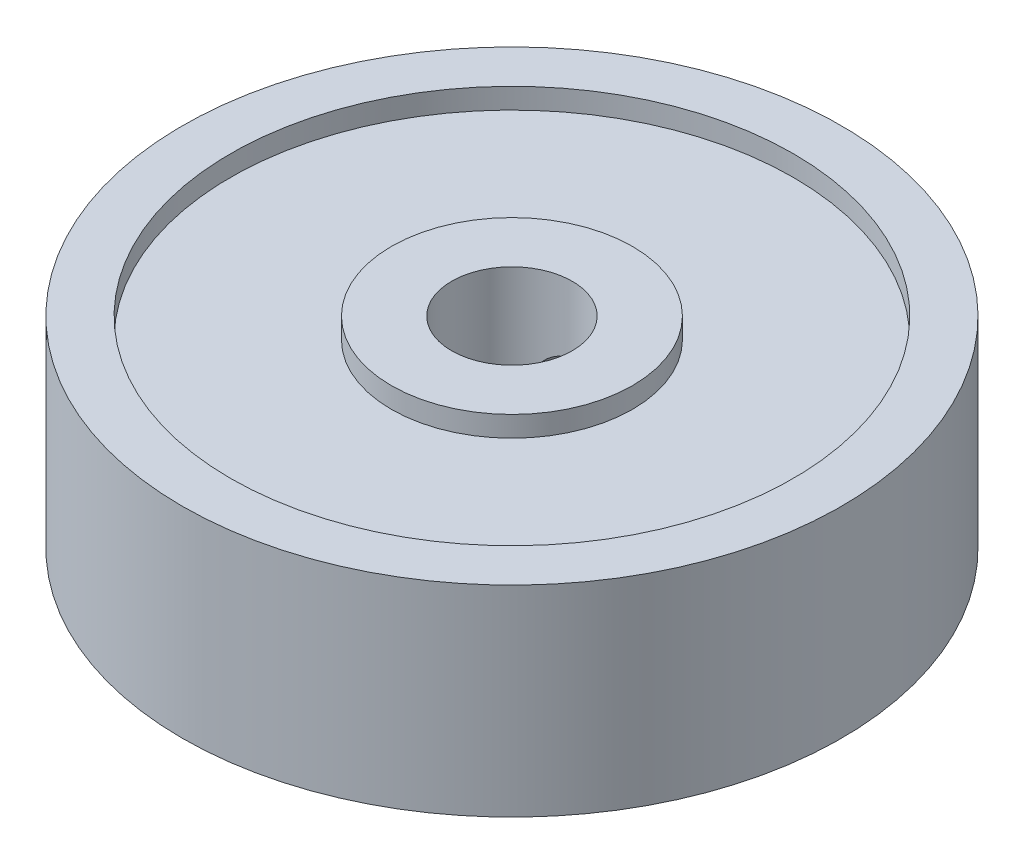
ISO-10303-21;
HEADER;
FILE_DESCRIPTION(('STEP AP214'),'2;1');
FILE_NAME('part.step','',(''),(''),'','','');
FILE_SCHEMA(('AUTOMOTIVE_DESIGN { 1 0 10303 214 1 1 1 1 }'));
ENDSEC;
DATA;
#1=APPLICATION_CONTEXT('core data for automotive mechanical design processes');
#2=APPLICATION_PROTOCOL_DEFINITION('international standard','automotive_design',2000,#1);
#3=PRODUCT_CONTEXT('',#1,'mechanical');
#4=PRODUCT('Part','Part','',(#3));
#5=PRODUCT_RELATED_PRODUCT_CATEGORY('part','',(#4));
#6=PRODUCT_DEFINITION_FORMATION('','',#4);
#7=PRODUCT_DEFINITION_CONTEXT('part definition',#1,'design');
#8=PRODUCT_DEFINITION('design','',#6,#7);
#9=PRODUCT_DEFINITION_SHAPE('','',#8);
#10=(LENGTH_UNIT() NAMED_UNIT(*) SI_UNIT(.MILLI.,.METRE.));
#11=(NAMED_UNIT(*) PLANE_ANGLE_UNIT() SI_UNIT($,.RADIAN.));
#12=(NAMED_UNIT(*) SI_UNIT($,.STERADIAN.) SOLID_ANGLE_UNIT());
#13=UNCERTAINTY_MEASURE_WITH_UNIT(LENGTH_MEASURE(1.E-05),#10,'distance_accuracy_value','');
#14=(GEOMETRIC_REPRESENTATION_CONTEXT(3) GLOBAL_UNCERTAINTY_ASSIGNED_CONTEXT((#13)) GLOBAL_UNIT_ASSIGNED_CONTEXT((#10,
#11,#12)) REPRESENTATION_CONTEXT('',''));
#15=CARTESIAN_POINT('',(0.,0.,0.));
#16=DIRECTION('',(0.,0.,1.));
#17=DIRECTION('',(1.,0.,0.));
#18=AXIS2_PLACEMENT_3D('',#15,#16,#17);
#19=CARTESIAN_POINT('',(0.,0.,0.));
#20=DIRECTION('',(0.,1.,0.));
#21=DIRECTION('',(0.,0.,1.));
#22=AXIS2_PLACEMENT_3D('',#19,#20,#21);
#23=PLANE('',#22);
#24=CARTESIAN_POINT('',(0.,0.,0.));
#25=DIRECTION('',(0.,1.,0.));
#26=DIRECTION('',(0.,0.,1.));
#27=AXIS2_PLACEMENT_3D('',#24,#25,#26);
#28=CIRCLE('',#27,2.38125);
#29=CARTESIAN_POINT('',(0.,0.,2.38125));
#30=VERTEX_POINT('',#29);
#31=EDGE_CURVE('E63',#30,#30,#28,.T.);
#32=ORIENTED_EDGE('',*,*,#31,.T.);
#33=EDGE_LOOP('',(#32));
#34=FACE_BOUND('',#33,.T.);
#35=CARTESIAN_POINT('',(0.,0.,0.));
#36=DIRECTION('',(0.,-1.,0.));
#37=DIRECTION('',(0.,0.,-1.));
#38=AXIS2_PLACEMENT_3D('',#35,#36,#37);
#39=CIRCLE('',#38,4.7625);
#40=CARTESIAN_POINT('',(0.,0.,-4.7625));
#41=VERTEX_POINT('',#40);
#42=EDGE_CURVE('E95',#41,#41,#39,.T.);
#43=ORIENTED_EDGE('',*,*,#42,.T.);
#44=EDGE_LOOP('',(#43));
#45=FACE_BOUND('',#44,.T.);
#46=ADVANCED_FACE('F40',(#34,#45),#23,.F.);
#47=CARTESIAN_POINT('',(0.,7.9375,0.));
#48=DIRECTION('',(0.,1.,0.));
#49=DIRECTION('',(0.,0.,1.));
#50=AXIS2_PLACEMENT_3D('',#47,#48,#49);
#51=PLANE('',#50);
#52=CARTESIAN_POINT('',(0.,7.9375,0.));
#53=DIRECTION('',(0.,1.,0.));
#54=DIRECTION('',(0.,0.,1.));
#55=AXIS2_PLACEMENT_3D('',#52,#53,#54);
#56=CIRCLE('',#55,2.38125);
#57=CARTESIAN_POINT('',(0.,7.9375,2.38125));
#58=VERTEX_POINT('',#57);
#59=EDGE_CURVE('E61',#58,#58,#56,.T.);
#60=ORIENTED_EDGE('',*,*,#59,.F.);
#61=EDGE_LOOP('',(#60));
#62=FACE_BOUND('',#61,.T.);
#63=CARTESIAN_POINT('',(0.,7.9375,0.));
#64=DIRECTION('',(0.,1.,0.));
#65=DIRECTION('',(0.,0.,1.));
#66=AXIS2_PLACEMENT_3D('',#63,#64,#65);
#67=CIRCLE('',#66,4.7625);
#68=CARTESIAN_POINT('',(0.,7.9375,4.7625));
#69=VERTEX_POINT('',#68);
#70=EDGE_CURVE('E79',#69,#69,#67,.T.);
#71=ORIENTED_EDGE('',*,*,#70,.T.);
#72=EDGE_LOOP('',(#71));
#73=FACE_BOUND('',#72,.T.);
#74=ADVANCED_FACE('F145',(#62,#73),#51,.T.);
#75=CARTESIAN_POINT('',(0.,7.9375,0.));
#76=DIRECTION('',(0.,1.,0.));
#77=DIRECTION('',(0.,0.,1.));
#78=AXIS2_PLACEMENT_3D('',#75,#76,#77);
#79=CIRCLE('',#78,11.1125);
#80=CARTESIAN_POINT('',(0.,7.9375,11.1125));
#81=VERTEX_POINT('',#80);
#82=EDGE_CURVE('E71',#81,#81,#79,.T.);
#83=ORIENTED_EDGE('',*,*,#82,.F.);
#84=EDGE_LOOP('',(#83));
#85=FACE_BOUND('',#84,.T.);
#86=CARTESIAN_POINT('',(0.,7.9375,0.));
#87=DIRECTION('',(0.,1.,0.));
#88=DIRECTION('',(0.,0.,1.));
#89=AXIS2_PLACEMENT_3D('',#86,#87,#88);
#90=CIRCLE('',#89,13.0175);
#91=CARTESIAN_POINT('',(0.,7.9375,13.0175));
#92=VERTEX_POINT('',#91);
#93=EDGE_CURVE('E10',#92,#92,#90,.T.);
#94=ORIENTED_EDGE('',*,*,#93,.T.);
#95=EDGE_LOOP('',(#94));
#96=FACE_BOUND('',#95,.T.);
#97=ADVANCED_FACE('F142',(#85,#96),#51,.T.);
#98=CARTESIAN_POINT('',(0.,0.,0.));
#99=DIRECTION('',(0.,-1.,0.));
#100=DIRECTION('',(0.,0.,-1.));
#101=AXIS2_PLACEMENT_3D('',#98,#99,#100);
#102=CIRCLE('',#101,11.1125);
#103=CARTESIAN_POINT('',(0.,0.,-11.1125));
#104=VERTEX_POINT('',#103);
#105=EDGE_CURVE('E87',#104,#104,#102,.T.);
#106=ORIENTED_EDGE('',*,*,#105,.F.);
#107=EDGE_LOOP('',(#106));
#108=FACE_BOUND('',#107,.T.);
#109=CARTESIAN_POINT('',(0.,0.,0.));
#110=DIRECTION('',(0.,1.,0.));
#111=DIRECTION('',(0.,0.,1.));
#112=AXIS2_PLACEMENT_3D('',#109,#110,#111);
#113=CIRCLE('',#112,13.0175);
#114=CARTESIAN_POINT('',(0.,0.,13.0175));
#115=VERTEX_POINT('',#114);
#116=EDGE_CURVE('E55',#115,#115,#113,.T.);
#117=ORIENTED_EDGE('',*,*,#116,.F.);
#118=EDGE_LOOP('',(#117));
#119=FACE_BOUND('',#118,.T.);
#120=ADVANCED_FACE('F144',(#108,#119),#23,.F.);
#121=CARTESIAN_POINT('',(0.,7.9375,0.));
#122=DIRECTION('',(0.,-1.,0.));
#123=DIRECTION('',(0.,0.,-1.));
#124=AXIS2_PLACEMENT_3D('',#121,#122,#123);
#125=CYLINDRICAL_SURFACE('',#124,13.0175);
#126=CARTESIAN_POINT('',(0.,5.25145,-13.0175));
#127=CARTESIAN_POINT('',(-0.0722167793868352,5.25144687090902,-13.0174991760839));
#128=CARTESIAN_POINT('',(-0.144481394680849,5.24536084028699,-13.016892660879));
#129=CARTESIAN_POINT('',(-0.287007425021183,5.22117420231504,-13.0145314728569));
#130=CARTESIAN_POINT('',(-0.357266539771132,5.20306033448345,-13.0127755328491));
#131=CARTESIAN_POINT('',(-0.49369699594001,5.155350290742,-13.0083137230122));
#132=CARTESIAN_POINT('',(-0.559870768593188,5.12576102184013,-13.0056084246919));
#133=CARTESIAN_POINT('',(-0.686298036440494,5.05595344688812,-12.9995504540223));
#134=CARTESIAN_POINT('',(-0.746552711247254,5.0157372645866,-12.9961979110584));
#135=CARTESIAN_POINT('',(-0.859658724760238,4.92566494760761,-12.9892077984795));
#136=CARTESIAN_POINT('',(-0.912486226026496,4.87577894376181,-12.9855693670416));
#137=CARTESIAN_POINT('',(-1.00903345734211,4.76784673572132,-12.9784246845783));
#138=CARTESIAN_POINT('',(-1.05275276750103,4.70980015552805,-12.9749184396528));
#139=CARTESIAN_POINT('',(-1.12992676863122,4.58704564331231,-12.9684262767254));
#140=CARTESIAN_POINT('',(-1.16335992872896,4.5223241121461,-12.9654414557283));
#141=CARTESIAN_POINT('',(-1.21887509882598,4.38815123171998,-12.9603407172327));
#142=CARTESIAN_POINT('',(-1.24095738416572,4.31869999723573,-12.9582247786578));
#143=CARTESIAN_POINT('',(-1.27307339994546,4.17728200877231,-12.9551091288351));
#144=CARTESIAN_POINT('',(-1.28314662074198,4.10532430498671,-12.9541057598023));
#145=CARTESIAN_POINT('',(-1.29108063280137,3.96073310942905,-12.9533174825286));
#146=CARTESIAN_POINT('',(-1.28894173921241,3.88809963514436,-12.9535325428446));
#147=CARTESIAN_POINT('',(-1.27254479281819,3.74449081565719,-12.9551534863571));
#148=CARTESIAN_POINT('',(-1.25832984559035,3.67351049422607,-12.9565551339581));
#149=CARTESIAN_POINT('',(-1.2182513667844,3.53494803097441,-12.9603847028793));
#150=CARTESIAN_POINT('',(-1.19238768060019,3.46736593426951,-12.9628126378208));
#151=CARTESIAN_POINT('',(-1.12969827552479,3.33738208534596,-12.9684260868901));
#152=CARTESIAN_POINT('',(-1.09285341849422,3.27498962253728,-12.971612921674));
#153=CARTESIAN_POINT('',(-1.0092613172447,3.15725778280901,-12.9783839693082));
#154=CARTESIAN_POINT('',(-0.962513788858436,3.10191860836376,-12.9819681935605));
#155=CARTESIAN_POINT('',(-0.860202516299438,2.9996137270853,-12.9891490381972));
#156=CARTESIAN_POINT('',(-0.804601542706041,2.9526852430084,-12.9927456452078));
#157=CARTESIAN_POINT('',(-0.686291001735636,2.8688223305971,-12.9995313697686));
#158=CARTESIAN_POINT('',(-0.623581426621689,2.83188791314031,-13.0027204868752));
#159=CARTESIAN_POINT('',(-0.492808089335158,2.76906311183093,-13.0083329221483));
#160=CARTESIAN_POINT('',(-0.424743421260517,2.74317460135357,-13.0107561103959));
#161=CARTESIAN_POINT('',(-0.285204097360968,2.70320369707423,-13.0145623222706));
#162=CARTESIAN_POINT('',(-0.213729541589824,2.68912095708933,-13.0159453763977));
#163=CARTESIAN_POINT('',(-0.0697217122020393,2.67320853784187,-13.0175115682286));
#164=CARTESIAN_POINT('',(0.00280583300064844,2.67132749072359,-13.017699736208));
#165=CARTESIAN_POINT('',(0.147143917587306,2.6797369590884,-13.0168684390531));
#166=CARTESIAN_POINT('',(0.218954466453988,2.69002731338174,-13.0158489899117));
#167=CARTESIAN_POINT('',(0.35967197178444,2.7224448665652,-13.012720245694));
#168=CARTESIAN_POINT('',(0.428584518918268,2.74454802926204,-13.0106131639819));
#169=CARTESIAN_POINT('',(0.561723589651604,2.79993907951676,-13.0055455619214));
#170=CARTESIAN_POINT('',(0.625950010086155,2.83322721322111,-13.0025850227912));
#171=CARTESIAN_POINT('',(0.748126021035909,2.91017077727365,-12.9961291788169));
#172=CARTESIAN_POINT('',(0.806054253055658,2.95385997469636,-12.9926321456749));
#173=CARTESIAN_POINT('',(0.913773354356421,3.05031705064278,-12.9855013131404));
#174=CARTESIAN_POINT('',(0.963564023367366,3.10308515253792,-12.9818675103846));
#175=CARTESIAN_POINT('',(1.05377284278088,3.21642619993197,-12.9748575726573));
#176=CARTESIAN_POINT('',(1.09415729262521,3.27702603526925,-12.9714823923916));
#177=CARTESIAN_POINT('',(1.16417567168309,3.40417763459615,-12.9653862934801));
#178=CARTESIAN_POINT('',(1.1938097454353,3.47072931854824,-12.962665366038));
#179=CARTESIAN_POINT('',(1.24142968949415,3.60777964356151,-12.958191754864));
#180=CARTESIAN_POINT('',(1.25943564835324,3.6782712478506,-12.9564374020671));
#181=CARTESIAN_POINT('',(1.2833534331722,3.82129552568008,-12.9540903559035));
#182=CARTESIAN_POINT('',(1.28926559865708,3.89382814186248,-12.953497629925));
#183=CARTESIAN_POINT('',(1.28882331010953,4.03854054882249,-12.9535416177654));
#184=CARTESIAN_POINT('',(1.282521796139,4.11072050885772,-12.9541730255927));
#185=CARTESIAN_POINT('',(1.25794198672222,4.25299107446052,-12.9565828255199));
#186=CARTESIAN_POINT('',(1.2396636774596,4.32308167761771,-12.9583612189429));
#187=CARTESIAN_POINT('',(1.19166366305701,4.45918375800441,-12.9628631418846));
#188=CARTESIAN_POINT('',(1.16194347399463,4.52519577431262,-12.9655865461824));
#189=CARTESIAN_POINT('',(1.09190883582393,4.65130282180553,-12.9716718820651));
#190=CARTESIAN_POINT('',(1.05159445278421,4.7113978898869,-12.9750338096679));
#191=CARTESIAN_POINT('',(0.961316969422817,4.82423646151812,-12.9820348344196));
#192=CARTESIAN_POINT('',(0.911314432296864,4.87694834611489,-12.9856750263013));
#193=CARTESIAN_POINT('',(0.803157742868454,4.97325674646547,-12.99281242308));
#194=CARTESIAN_POINT('',(0.745001639642649,5.01685107440079,-12.9963095934966));
#195=CARTESIAN_POINT('',(0.622031648644326,5.09377134306111,-13.0027758711551));
#196=CARTESIAN_POINT('',(0.557201635350246,5.12707159631759,-13.0057436496975));
#197=CARTESIAN_POINT('',(0.422882380692282,5.18226922970302,-13.0108022464196));
#198=CARTESIAN_POINT('',(0.353398499761982,5.20417948254893,-13.0128940540791));
#199=CARTESIAN_POINT('',(0.236266848380609,5.23050440764046,-13.0154386925157));
#200=CARTESIAN_POINT('',(0.189368128460374,5.23834829126552,-13.016208083682));
#201=CARTESIAN_POINT('',(0.0949865034978478,5.24882210609786,-13.0172390073847));
#202=CARTESIAN_POINT('',(0.0475036008075509,5.25145205829019,-13.0175005419652));
#203=CARTESIAN_POINT('',(0.,5.25145,-13.0175));
#204=B_SPLINE_CURVE_WITH_KNOTS('',3,(#126,#127,#128,#129,#130,#131,#132,#133,#134,#135,#136,
#137,#138,#139,#140,#141,#142,#143,#144,#145,#146,#147,#148,#149,#150,#151,#152,#153,#154,#155,
#156,#157,#158,#159,#160,#161,#162,#163,#164,#165,#166,#167,#168,#169,#170,#171,#172,#173,#174,
#175,#176,#177,#178,#179,#180,#181,#182,#183,#184,#185,#186,#187,#188,#189,#190,#191,#192,#193,
#194,#195,#196,#197,#198,#199,#200,#201,#202,#203),.UNSPECIFIED.,.T.,.F.,(4,2,2,2,2,2,2,2,2,2,2,
2,2,2,2,2,2,2,2,2,2,2,2,2,2,2,2,2,2,2,2,2,2,2,2,2,2,2,4),(0.,0.216476874347898,
0.433192807830938,0.649778502609208,0.866320946244415,1.08354324626585,1.30077555808771,
1.51845953258564,1.73613822643033,1.95309911822385,2.17005441110832,2.38623851848551,
2.60242549521761,2.8189914710935,3.03556366239442,3.25307185206232,3.47058027846654,
3.68812557944243,3.90566450107184,4.12228700883853,4.33890664783602,4.55508718735433,
4.77127248464647,4.98816943595085,5.20507172440943,5.42273956933935,5.64040448761966,
5.85769235820733,6.07497412850237,6.29131619919596,6.50765851946104,6.72397218369003,
6.94028449895356,7.15749657601424,7.37476071491168,7.59256271036567,7.81011801289964,
7.95251528538149,8.09491198474141),.UNSPECIFIED.);
#205=CARTESIAN_POINT('',(0.,5.25145,-13.0175));
#206=VERTEX_POINT('',#205);
#207=EDGE_CURVE('E99',#206,#206,#204,.T.);
#208=ORIENTED_EDGE('',*,*,#207,.T.);
#209=EDGE_LOOP('',(#208));
#210=FACE_BOUND('',#209,.T.);
#211=ORIENTED_EDGE('',*,*,#93,.F.);
#212=EDGE_LOOP('',(#211));
#213=FACE_BOUND('',#212,.T.);
#214=ORIENTED_EDGE('',*,*,#116,.T.);
#215=EDGE_LOOP('',(#214));
#216=FACE_BOUND('',#215,.T.);
#217=ADVANCED_FACE('F42',(#210,#213,#216),#125,.T.);
#218=CARTESIAN_POINT('',(0.,7.9375,0.));
#219=DIRECTION('',(0.,-1.,0.));
#220=DIRECTION('',(0.,0.,-1.));
#221=AXIS2_PLACEMENT_3D('',#218,#219,#220);
#222=CYLINDRICAL_SURFACE('',#221,2.38125);
#223=CARTESIAN_POINT('',(0.,5.25145,-2.38125));
#224=CARTESIAN_POINT('',(-0.0670780430534094,5.25144569176948,-2.38124613399452));
#225=CARTESIAN_POINT('',(-0.134214985193692,5.24618384664008,-2.37838656639954));
#226=CARTESIAN_POINT('',(-0.266461279378864,5.22539022613831,-2.36722876027952));
#227=CARTESIAN_POINT('',(-0.331567523242931,5.20984344579486,-2.35892257569309));
#228=CARTESIAN_POINT('',(-0.457647113006735,5.169287406801,-2.33773012184516));
#229=CARTESIAN_POINT('',(-0.518636151439408,5.14431678524224,-2.32486256678877));
#230=CARTESIAN_POINT('',(-0.635443023414842,5.08584671503041,-2.29569016082552));
#231=CARTESIAN_POINT('',(-0.691260736809858,5.05234706828636,-2.27938523008535));
#232=CARTESIAN_POINT('',(-0.800370375861932,4.97522617440205,-2.24349624865379));
#233=CARTESIAN_POINT('',(-0.853238527175172,4.93107492911049,-2.22376525791681));
#234=CARTESIAN_POINT('',(-0.951219389146956,4.83506459628848,-2.18365324821674));
#235=CARTESIAN_POINT('',(-0.996325089282197,4.78319861931397,-2.1632716611651));
#236=CARTESIAN_POINT('',(-1.08180979631269,4.66737891136848,-2.12190976821722));
#237=CARTESIAN_POINT('',(-1.12133696318453,4.60274565832405,-2.10105547632694));
#238=CARTESIAN_POINT('',(-1.18880360780542,4.46654120037051,-2.06363620223279));
#239=CARTESIAN_POINT('',(-1.21675215124313,4.3949754777408,-2.0470678680946));
#240=CARTESIAN_POINT('',(-1.25830439553133,4.25143316389062,-2.02177750137033));
#241=CARTESIAN_POINT('',(-1.27269972643964,4.17976548606782,-2.01262753257827));
#242=CARTESIAN_POINT('',(-1.28909829950411,4.03450044916586,-2.00216973403035));
#243=CARTESIAN_POINT('',(-1.29111817082431,3.9609058130685,-2.00085138084125));
#244=CARTESIAN_POINT('',(-1.28328572015746,3.82549522029004,-2.00587495881525));
#245=CARTESIAN_POINT('',(-1.2751253623968,3.76352976699165,-2.01112550742086));
#246=CARTESIAN_POINT('',(-1.2501464312604,3.64203812768976,-2.02674628660171));
#247=CARTESIAN_POINT('',(-1.233324163163,3.58251299430705,-2.03711870182212));
#248=CARTESIAN_POINT('',(-1.19125790610135,3.46592896409412,-2.06200414222651));
#249=CARTESIAN_POINT('',(-1.1658362029797,3.40895351786419,-2.07660351792067));
#250=CARTESIAN_POINT('',(-1.1074423406342,3.29978551467399,-2.10832311380786));
#251=CARTESIAN_POINT('',(-1.07446687133488,3.2475950685908,-2.12544443794615));
#252=CARTESIAN_POINT('',(-0.996075070377776,3.14112461552098,-2.16341312113382));
#253=CARTESIAN_POINT('',(-0.949529407958072,3.08773385908556,-2.18443115301848));
#254=CARTESIAN_POINT('',(-0.848150657976682,2.9891088920066,-2.22575621693785));
#255=CARTESIAN_POINT('',(-0.793312266124543,2.94387994281826,-2.24606278358338));
#256=CARTESIAN_POINT('',(-0.672584089155389,2.86012609517599,-2.28522493826591));
#257=CARTESIAN_POINT('',(-0.606215394797943,2.82220404028082,-2.3039082027636));
#258=CARTESIAN_POINT('',(-0.466782659091959,2.75839570992361,-2.33614367815434));
#259=CARTESIAN_POINT('',(-0.393724821670125,2.73249841464663,-2.34970058485657));
#260=CARTESIAN_POINT('',(-0.250135372203472,2.69588537737887,-2.36908082280933));
#261=CARTESIAN_POINT('',(-0.179983961304692,2.68399763830182,-2.37549812530283));
#262=CARTESIAN_POINT('',(-0.038404593607944,2.67196876276996,-2.38199204312792));
#263=CARTESIAN_POINT('',(0.0330225624084973,2.67182049989609,-2.38207250522212));
#264=CARTESIAN_POINT('',(0.167947302785588,2.68271612363818,-2.37618972032186));
#265=CARTESIAN_POINT('',(0.231558887780283,2.69270875350144,-2.3707941435787));
#266=CARTESIAN_POINT('',(0.356043538391642,2.72184763301991,-2.35531732772887));
#267=CARTESIAN_POINT('',(0.41691632223396,2.74099482217246,-2.34523560770422));
#268=CARTESIAN_POINT('',(0.535919872036504,2.78824570234651,-2.32097395168795));
#269=CARTESIAN_POINT('',(0.593950872962233,2.81655174694081,-2.30670217330131));
#270=CARTESIAN_POINT('',(0.704599487329642,2.88106021089265,-2.27534684605844));
#271=CARTESIAN_POINT('',(0.757215038920859,2.91726562156681,-2.25826223264636));
#272=CARTESIAN_POINT('',(0.861688040148227,3.00109448108781,-2.22064300834147));
#273=CARTESIAN_POINT('',(0.912828291803232,3.04953503048556,-2.19993555128704));
#274=CARTESIAN_POINT('',(1.00663390206836,3.15414193302797,-2.15862741795572));
#275=CARTESIAN_POINT('',(1.04929093207389,3.21031578788412,-2.13802686576642));
#276=CARTESIAN_POINT('',(1.12792529898915,3.33377615486932,-2.09767204761262));
#277=CARTESIAN_POINT('',(1.16319760620222,3.40157226700538,-2.07808638743874));
#278=CARTESIAN_POINT('',(1.22148302088246,3.54348390441834,-2.04437701641253));
#279=CARTESIAN_POINT('',(1.24451382402032,3.61759012722556,-2.03024542958419));
#280=CARTESIAN_POINT('',(1.27537106154919,3.76238145258208,-2.01099061107686));
#281=CARTESIAN_POINT('',(1.28446262526353,3.83269395143266,-2.00512244605583));
#282=CARTESIAN_POINT('',(1.29093335549412,3.97405874047408,-2.00096564371573));
#283=CARTESIAN_POINT('',(1.28832143899439,4.04511042630444,-2.00267123587588));
#284=CARTESIAN_POINT('',(1.27268476068895,4.17621190996039,-2.01263184646028));
#285=CARTESIAN_POINT('',(1.2610403892226,4.23650274345325,-2.02001759779247));
#286=CARTESIAN_POINT('',(1.22958938851025,4.35415228698596,-2.03931357355905));
#287=CARTESIAN_POINT('',(1.20977958849771,4.41150984825274,-2.05122555546057));
#288=CARTESIAN_POINT('',(1.16120925340406,4.52572596459141,-2.07912800874946));
#289=CARTESIAN_POINT('',(1.13196301611885,4.58232491386902,-2.09532831840969));
#290=CARTESIAN_POINT('',(1.0658219723022,4.69019195520782,-2.12973350297145));
#291=CARTESIAN_POINT('',(1.02892306413612,4.74145716630483,-2.14793945037985));
#292=CARTESIAN_POINT('',(0.942051021016384,4.84525441281654,-2.18757793999601));
#293=CARTESIAN_POINT('',(0.890946053267661,4.89681643060788,-2.20908379422576));
#294=CARTESIAN_POINT('',(0.780395204153612,4.99094511021128,-2.25051536547034));
#295=CARTESIAN_POINT('',(0.720943696594509,5.03350565544649,-2.27044000232725));
#296=CARTESIAN_POINT('',(0.593005924572014,5.1094333090246,-2.30721727712529));
#297=CARTESIAN_POINT('',(0.524306931860827,5.14249651056797,-2.3239635252862));
#298=CARTESIAN_POINT('',(0.38120357680206,5.1961490685471,-2.35166019240076));
#299=CARTESIAN_POINT('',(0.306814754706162,5.21677112401975,-2.36262579494352));
#300=CARTESIAN_POINT('',(0.192961197057801,5.23751333710277,-2.37372857105327));
#301=CARTESIAN_POINT('',(0.15461710838164,5.24272897120786,-2.37653860747527));
#302=CARTESIAN_POINT('',(0.0775219058137578,5.24969855008545,-2.38030044048222));
#303=CARTESIAN_POINT('',(0.0387707913670013,5.25145249013684,-2.38125223453287));
#304=CARTESIAN_POINT('',(0.,5.25145,-2.38125));
#305=B_SPLINE_CURVE_WITH_KNOTS('',3,(#223,#224,#225,#226,#227,#228,#229,#230,#231,#232,#233,
#234,#235,#236,#237,#238,#239,#240,#241,#242,#243,#244,#245,#246,#247,#248,#249,#250,#251,#252,
#253,#254,#255,#256,#257,#258,#259,#260,#261,#262,#263,#264,#265,#266,#267,#268,#269,#270,#271,
#272,#273,#274,#275,#276,#277,#278,#279,#280,#281,#282,#283,#284,#285,#286,#287,#288,#289,#290,
#291,#292,#293,#294,#295,#296,#297,#298,#299,#300,#301,#302,#303,#304),.UNSPECIFIED.,.T.,.F.,(4,
2,2,2,2,2,2,2,2,2,2,2,2,2,2,2,2,2,2,2,2,2,2,2,2,2,2,2,2,2,2,2,2,2,2,2,2,2,2,2,4),(0.,
0.2010778689958,0.402449744817127,0.603004824442281,0.803564562486921,1.01764142368228,
1.23191062146511,1.46646643238452,1.70083824499156,1.92046990251478,2.13980637154258,
2.32708706316471,2.51444770527351,2.70594438857988,2.89752514718521,3.11824085853014,
3.33909834844397,3.57388721100614,3.80846047995678,4.02157695275901,4.23456405275826,
4.42752073592858,4.62049722575569,4.81806738508619,5.01571249015462,5.23505297828444,
5.45460775744733,5.69002108710267,5.92509318378987,6.13720975565111,6.34916474153195,
6.5338985976719,6.71870425660514,6.91516501436054,7.11173134341577,7.33787403229182,
7.56416989681448,7.79705750665689,8.02933032117448,8.14555221913495,8.26177427560058),.UNSPECIFIED.);
#306=CARTESIAN_POINT('',(0.,5.25145,-2.38125));
#307=VERTEX_POINT('',#306);
#308=EDGE_CURVE('E45',#307,#307,#305,.T.);
#309=ORIENTED_EDGE('',*,*,#308,.F.);
#310=EDGE_LOOP('',(#309));
#311=FACE_BOUND('',#310,.T.);
#312=ORIENTED_EDGE('',*,*,#59,.T.);
#313=EDGE_LOOP('',(#312));
#314=FACE_BOUND('',#313,.T.);
#315=ORIENTED_EDGE('',*,*,#31,.F.);
#316=EDGE_LOOP('',(#315));
#317=FACE_BOUND('',#316,.T.);
#318=ADVANCED_FACE('F136',(#311,#314,#317),#222,.F.);
#319=CARTESIAN_POINT('',(0.,7.1247,0.));
#320=DIRECTION('',(0.,1.,0.));
#321=DIRECTION('',(0.,0.,1.));
#322=AXIS2_PLACEMENT_3D('',#319,#320,#321);
#323=CYLINDRICAL_SURFACE('',#322,11.1125);
#324=CARTESIAN_POINT('',(0.,7.1247,0.));
#325=DIRECTION('',(0.,1.,0.));
#326=DIRECTION('',(0.,0.,1.));
#327=AXIS2_PLACEMENT_3D('',#324,#325,#326);
#328=CIRCLE('',#327,11.1125);
#329=CARTESIAN_POINT('',(0.,7.1247,11.1125));
#330=VERTEX_POINT('',#329);
#331=EDGE_CURVE('E67',#330,#330,#328,.T.);
#332=ORIENTED_EDGE('',*,*,#331,.F.);
#333=EDGE_LOOP('',(#332));
#334=FACE_BOUND('',#333,.T.);
#335=ORIENTED_EDGE('',*,*,#82,.T.);
#336=EDGE_LOOP('',(#335));
#337=FACE_BOUND('',#336,.T.);
#338=ADVANCED_FACE('F133',(#334,#337),#323,.F.);
#339=CARTESIAN_POINT('',(0.,7.1247,0.));
#340=DIRECTION('',(0.,1.,0.));
#341=DIRECTION('',(0.,0.,1.));
#342=AXIS2_PLACEMENT_3D('',#339,#340,#341);
#343=PLANE('',#342);
#344=CARTESIAN_POINT('',(0.,7.1247,0.));
#345=DIRECTION('',(0.,1.,0.));
#346=DIRECTION('',(0.,0.,1.));
#347=AXIS2_PLACEMENT_3D('',#344,#345,#346);
#348=CIRCLE('',#347,4.7625);
#349=CARTESIAN_POINT('',(0.,7.1247,4.7625));
#350=VERTEX_POINT('',#349);
#351=EDGE_CURVE('E75',#350,#350,#348,.T.);
#352=ORIENTED_EDGE('',*,*,#351,.F.);
#353=EDGE_LOOP('',(#352));
#354=FACE_BOUND('',#353,.T.);
#355=ORIENTED_EDGE('',*,*,#331,.T.);
#356=EDGE_LOOP('',(#355));
#357=FACE_BOUND('',#356,.T.);
#358=ADVANCED_FACE('F129',(#354,#357),#343,.T.);
#359=CARTESIAN_POINT('',(0.,7.1247,0.));
#360=DIRECTION('',(0.,1.,0.));
#361=DIRECTION('',(0.,0.,1.));
#362=AXIS2_PLACEMENT_3D('',#359,#360,#361);
#363=CYLINDRICAL_SURFACE('',#362,4.7625);
#364=ORIENTED_EDGE('',*,*,#351,.T.);
#365=EDGE_LOOP('',(#364));
#366=FACE_BOUND('',#365,.T.);
#367=ORIENTED_EDGE('',*,*,#70,.F.);
#368=EDGE_LOOP('',(#367));
#369=FACE_BOUND('',#368,.T.);
#370=ADVANCED_FACE('F125',(#366,#369),#363,.T.);
#371=CARTESIAN_POINT('',(0.,0.8128,0.));
#372=DIRECTION('',(0.,-1.,0.));
#373=DIRECTION('',(0.,0.,-1.));
#374=AXIS2_PLACEMENT_3D('',#371,#372,#373);
#375=CYLINDRICAL_SURFACE('',#374,11.1125);
#376=CARTESIAN_POINT('',(0.,0.8128,0.));
#377=DIRECTION('',(0.,-1.,0.));
#378=DIRECTION('',(0.,0.,-1.));
#379=AXIS2_PLACEMENT_3D('',#376,#377,#378);
#380=CIRCLE('',#379,11.1125);
#381=CARTESIAN_POINT('',(0.,0.8128,-11.1125));
#382=VERTEX_POINT('',#381);
#383=EDGE_CURVE('E83',#382,#382,#380,.T.);
#384=ORIENTED_EDGE('',*,*,#383,.F.);
#385=EDGE_LOOP('',(#384));
#386=FACE_BOUND('',#385,.T.);
#387=ORIENTED_EDGE('',*,*,#105,.T.);
#388=EDGE_LOOP('',(#387));
#389=FACE_BOUND('',#388,.T.);
#390=ADVANCED_FACE('F121',(#386,#389),#375,.F.);
#391=CARTESIAN_POINT('',(0.,0.8128,0.));
#392=DIRECTION('',(0.,-1.,0.));
#393=DIRECTION('',(0.,0.,-1.));
#394=AXIS2_PLACEMENT_3D('',#391,#392,#393);
#395=PLANE('',#394);
#396=CARTESIAN_POINT('',(0.,0.8128,0.));
#397=DIRECTION('',(0.,-1.,0.));
#398=DIRECTION('',(0.,0.,-1.));
#399=AXIS2_PLACEMENT_3D('',#396,#397,#398);
#400=CIRCLE('',#399,4.7625);
#401=CARTESIAN_POINT('',(0.,0.8128,-4.7625));
#402=VERTEX_POINT('',#401);
#403=EDGE_CURVE('E91',#402,#402,#400,.T.);
#404=ORIENTED_EDGE('',*,*,#403,.F.);
#405=EDGE_LOOP('',(#404));
#406=FACE_BOUND('',#405,.T.);
#407=ORIENTED_EDGE('',*,*,#383,.T.);
#408=EDGE_LOOP('',(#407));
#409=FACE_BOUND('',#408,.T.);
#410=ADVANCED_FACE('F117',(#406,#409),#395,.T.);
#411=CARTESIAN_POINT('',(0.,0.8128,0.));
#412=DIRECTION('',(0.,-1.,0.));
#413=DIRECTION('',(0.,0.,-1.));
#414=AXIS2_PLACEMENT_3D('',#411,#412,#413);
#415=CYLINDRICAL_SURFACE('',#414,4.7625);
#416=ORIENTED_EDGE('',*,*,#403,.T.);
#417=EDGE_LOOP('',(#416));
#418=FACE_BOUND('',#417,.T.);
#419=ORIENTED_EDGE('',*,*,#42,.F.);
#420=EDGE_LOOP('',(#419));
#421=FACE_BOUND('',#420,.T.);
#422=ADVANCED_FACE('F112',(#418,#421),#415,.T.);
#423=CARTESIAN_POINT('',(0.,3.9624,-13.0175));
#424=DIRECTION('',(0.,0.,1.));
#425=DIRECTION('',(1.,0.,0.));
#426=AXIS2_PLACEMENT_3D('',#423,#424,#425);
#427=CYLINDRICAL_SURFACE('',#426,1.28905);
#428=ORIENTED_EDGE('',*,*,#308,.T.);
#429=EDGE_LOOP('',(#428));
#430=FACE_BOUND('',#429,.T.);
#431=ORIENTED_EDGE('',*,*,#207,.F.);
#432=EDGE_LOOP('',(#431));
#433=FACE_BOUND('',#432,.T.);
#434=ADVANCED_FACE('F108',(#430,#433),#427,.F.);
#435=CLOSED_SHELL('',(#46,#74,#97,#120,#217,#318,#338,#358,#370,#390,#410,#422,#434));
#436=MANIFOLD_SOLID_BREP('B2',#435);
#437=ADVANCED_BREP_SHAPE_REPRESENTATION('',(#18,#436),#14);
#438=SHAPE_DEFINITION_REPRESENTATION(#9,#437);
ENDSEC;
END-ISO-10303-21;
